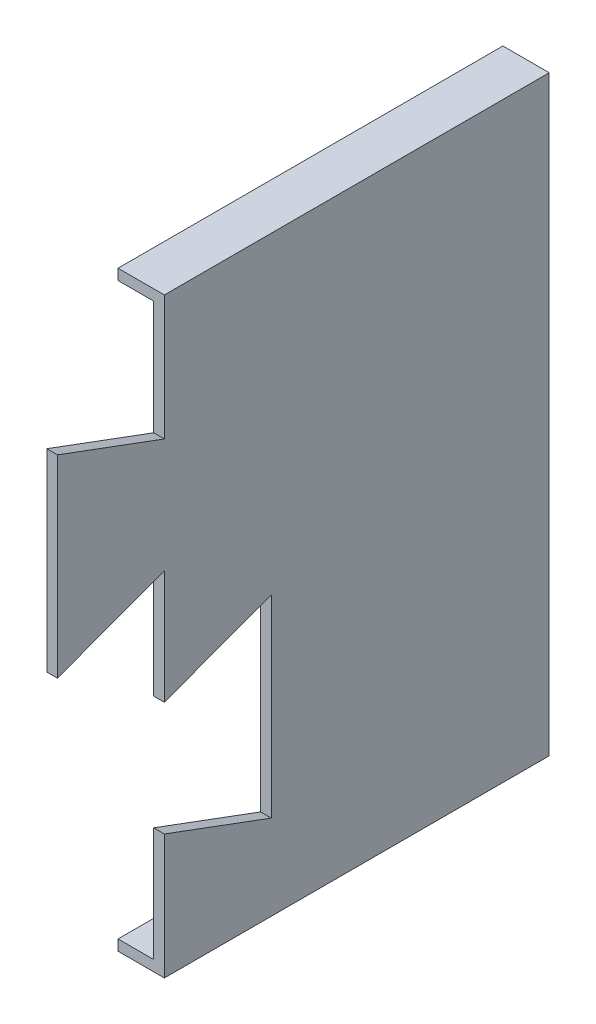
ISO-10303-21;
HEADER;
FILE_DESCRIPTION(('STEP AP214'),'2;1');
FILE_NAME('part.step','',(''),(''),'','','');
FILE_SCHEMA(('AUTOMOTIVE_DESIGN { 1 0 10303 214 1 1 1 1 }'));
ENDSEC;
DATA;
#1=APPLICATION_CONTEXT('core data for automotive mechanical design processes');
#2=APPLICATION_PROTOCOL_DEFINITION('international standard','automotive_design',2000,#1);
#3=PRODUCT_CONTEXT('',#1,'mechanical');
#4=PRODUCT('Part','Part','',(#3));
#5=PRODUCT_RELATED_PRODUCT_CATEGORY('part','',(#4));
#6=PRODUCT_DEFINITION_FORMATION('','',#4);
#7=PRODUCT_DEFINITION_CONTEXT('part definition',#1,'design');
#8=PRODUCT_DEFINITION('design','',#6,#7);
#9=PRODUCT_DEFINITION_SHAPE('','',#8);
#10=(LENGTH_UNIT() NAMED_UNIT(*) SI_UNIT(.MILLI.,.METRE.));
#11=(NAMED_UNIT(*) PLANE_ANGLE_UNIT() SI_UNIT($,.RADIAN.));
#12=(NAMED_UNIT(*) SI_UNIT($,.STERADIAN.) SOLID_ANGLE_UNIT());
#13=UNCERTAINTY_MEASURE_WITH_UNIT(LENGTH_MEASURE(1.E-05),#10,'distance_accuracy_value','');
#14=(GEOMETRIC_REPRESENTATION_CONTEXT(3) GLOBAL_UNCERTAINTY_ASSIGNED_CONTEXT((#13)) GLOBAL_UNIT_ASSIGNED_CONTEXT((#10,
#11,#12)) REPRESENTATION_CONTEXT('',''));
#15=CARTESIAN_POINT('',(0.,0.,0.));
#16=DIRECTION('',(0.,0.,1.));
#17=DIRECTION('',(1.,0.,0.));
#18=AXIS2_PLACEMENT_3D('',#15,#16,#17);
#19=CARTESIAN_POINT('',(-21.6440580045063,19.0350877192983,3.));
#20=DIRECTION('',(1.,0.,0.));
#21=DIRECTION('',(0.,1.,0.));
#22=AXIS2_PLACEMENT_3D('',#19,#20,#21);
#23=PLANE('',#22);
#24=DIRECTION('',(0.,-1.,0.));
#25=VECTOR('',#24,1.);
#26=CARTESIAN_POINT('',(-21.6440580045063,0.,108.));
#27=LINE('',#26,#25);
#28=CARTESIAN_POINT('',(-21.6440580045063,-140.964912280702,108.));
#29=VERTEX_POINT('',#28);
#30=CARTESIAN_POINT('',(-21.6440580045063,-143.964912280702,108.));
#31=VERTEX_POINT('',#30);
#32=EDGE_CURVE('E151',#29,#31,#27,.T.);
#33=ORIENTED_EDGE('',*,*,#32,.F.);
#34=DIRECTION('',(0.,0.,-1.));
#35=VECTOR('',#34,1.);
#36=CARTESIAN_POINT('',(-21.6440580045063,-140.964912280702,0.));
#37=LINE('',#36,#35);
#38=CARTESIAN_POINT('',(-21.6440580045063,-140.964912280702,3.));
#39=VERTEX_POINT('',#38);
#40=EDGE_CURVE('E182',#29,#39,#37,.T.);
#41=ORIENTED_EDGE('',*,*,#40,.T.);
#42=DIRECTION('',(0.,-1.,0.));
#43=VECTOR('',#42,1.);
#44=CARTESIAN_POINT('',(-21.6440580045063,19.0350877192983,3.));
#45=LINE('',#44,#43);
#46=CARTESIAN_POINT('',(-21.6440580045063,19.0350877192983,3.));
#47=VERTEX_POINT('',#46);
#48=EDGE_CURVE('E213',#47,#39,#45,.T.);
#49=ORIENTED_EDGE('',*,*,#48,.F.);
#50=DIRECTION('',(0.,0.,1.));
#51=VECTOR('',#50,1.);
#52=CARTESIAN_POINT('',(-21.6440580045063,19.0350877192983,0.));
#53=LINE('',#52,#51);
#54=CARTESIAN_POINT('',(-21.6440580045063,19.0350877192983,108.));
#55=VERTEX_POINT('',#54);
#56=EDGE_CURVE('E190',#47,#55,#53,.T.);
#57=ORIENTED_EDGE('',*,*,#56,.T.);
#58=DIRECTION('',(0.,-1.,0.));
#59=VECTOR('',#58,1.);
#60=CARTESIAN_POINT('',(-21.6440580045063,0.,108.));
#61=LINE('',#60,#59);
#62=CARTESIAN_POINT('',(-21.6440580045063,22.0350877192983,108.));
#63=VERTEX_POINT('',#62);
#64=EDGE_CURVE('E62',#63,#55,#61,.T.);
#65=ORIENTED_EDGE('',*,*,#64,.F.);
#66=DIRECTION('',(0.,0.,1.));
#67=VECTOR('',#66,1.);
#68=CARTESIAN_POINT('',(-21.6440580045063,22.0350877192983,0.));
#69=LINE('',#68,#67);
#70=CARTESIAN_POINT('',(-21.6440580045063,22.0350877192983,0.));
#71=VERTEX_POINT('',#70);
#72=EDGE_CURVE('E306',#71,#63,#69,.T.);
#73=ORIENTED_EDGE('',*,*,#72,.F.);
#74=DIRECTION('',(0.,-1.,0.));
#75=VECTOR('',#74,1.);
#76=CARTESIAN_POINT('',(-21.6440580045063,19.0350877192983,0.));
#77=LINE('',#76,#75);
#78=CARTESIAN_POINT('',(-21.6440580045063,-143.964912280702,0.));
#79=VERTEX_POINT('',#78);
#80=EDGE_CURVE('E178',#71,#79,#77,.T.);
#81=ORIENTED_EDGE('',*,*,#80,.T.);
#82=DIRECTION('',(0.,0.,-1.));
#83=VECTOR('',#82,1.);
#84=CARTESIAN_POINT('',(-21.6440580045063,-143.964912280702,0.));
#85=LINE('',#84,#83);
#86=EDGE_CURVE('E169',#31,#79,#85,.T.);
#87=ORIENTED_EDGE('',*,*,#86,.F.);
#88=EDGE_LOOP('',(#33,#41,#49,#57,#65,#73,#81,#87));
#89=FACE_BOUND('',#88,.T.);
#90=ADVANCED_FACE('F39',(#89),#23,.F.);
#91=CARTESIAN_POINT('',(-8.64405800450632,19.0350877192983,3.));
#92=DIRECTION('',(-1.,0.,0.));
#93=DIRECTION('',(0.,-1.,0.));
#94=AXIS2_PLACEMENT_3D('',#91,#92,#93);
#95=PLANE('',#94);
#96=DIRECTION('',(0.,-1.,0.));
#97=VECTOR('',#96,1.);
#98=CARTESIAN_POINT('',(-8.64405800450632,0.,108.));
#99=LINE('',#98,#97);
#100=CARTESIAN_POINT('',(-8.64405800450631,-108.964912280702,108.));
#101=VERTEX_POINT('',#100);
#102=CARTESIAN_POINT('',(-8.6440580045063,-143.964912280702,108.));
#103=VERTEX_POINT('',#102);
#104=EDGE_CURVE('E289',#101,#103,#99,.T.);
#105=ORIENTED_EDGE('',*,*,#104,.T.);
#106=DIRECTION('',(0.,0.,1.));
#107=VECTOR('',#106,1.);
#108=CARTESIAN_POINT('',(-8.64405800450632,-143.964912280702,0.));
#109=LINE('',#108,#107);
#110=CARTESIAN_POINT('',(-8.64405800450632,-143.964912280702,0.));
#111=VERTEX_POINT('',#110);
#112=EDGE_CURVE('E172',#111,#103,#109,.T.);
#113=ORIENTED_EDGE('',*,*,#112,.F.);
#114=DIRECTION('',(0.,1.,0.));
#115=VECTOR('',#114,1.);
#116=CARTESIAN_POINT('',(-8.64405800450632,19.0350877192983,0.));
#117=LINE('',#116,#115);
#118=CARTESIAN_POINT('',(-8.64405800450632,22.0350877192983,0.));
#119=VERTEX_POINT('',#118);
#120=EDGE_CURVE('E218',#111,#119,#117,.T.);
#121=ORIENTED_EDGE('',*,*,#120,.T.);
#122=DIRECTION('',(0.,0.,-1.));
#123=VECTOR('',#122,1.);
#124=CARTESIAN_POINT('',(-8.64405800450632,22.0350877192983,0.));
#125=LINE('',#124,#123);
#126=CARTESIAN_POINT('',(-8.64405800450633,22.0350877192983,108.));
#127=VERTEX_POINT('',#126);
#128=EDGE_CURVE('E310',#127,#119,#125,.T.);
#129=ORIENTED_EDGE('',*,*,#128,.F.);
#130=DIRECTION('',(0.,-1.,0.));
#131=VECTOR('',#130,1.);
#132=CARTESIAN_POINT('',(-8.64405800450632,0.,108.));
#133=LINE('',#132,#131);
#134=CARTESIAN_POINT('',(-8.64405800450632,-12.9649122807017,108.));
#135=VERTEX_POINT('',#134);
#136=EDGE_CURVE('E277',#127,#135,#133,.T.);
#137=ORIENTED_EDGE('',*,*,#136,.T.);
#138=DIRECTION('',(0.,-0.347985272676877,-0.9375));
#139=VECTOR('',#138,1.);
#140=CARTESIAN_POINT('',(-8.64405800450632,-46.6284512927443,17.3077486267798));
#141=LINE('',#140,#139);
#142=CARTESIAN_POINT('',(-8.64405800450632,-1.82938355504168,138.));
#143=VERTEX_POINT('',#142);
#144=EDGE_CURVE('E278',#143,#135,#141,.T.);
#145=ORIENTED_EDGE('',*,*,#144,.F.);
#146=DIRECTION('',(0.,1.,0.));
#147=VECTOR('',#146,1.);
#148=CARTESIAN_POINT('',(-8.64405800450632,19.0350877192983,138.));
#149=LINE('',#148,#147);
#150=CARTESIAN_POINT('',(-8.64405800450631,-56.1004410063618,138.));
#151=VERTEX_POINT('',#150);
#152=EDGE_CURVE('E196',#151,#143,#149,.T.);
#153=ORIENTED_EDGE('',*,*,#152,.F.);
#154=DIRECTION('',(0.,-0.347985272676877,0.9375));
#155=VECTOR('',#154,1.);
#156=CARTESIAN_POINT('',(-8.64405800450632,-4.28643357567676,-1.59105680708607));
#157=LINE('',#156,#155);
#158=CARTESIAN_POINT('',(-8.64405800450632,-44.9649122807017,108.));
#159=VERTEX_POINT('',#158);
#160=EDGE_CURVE('E163',#159,#151,#157,.T.);
#161=ORIENTED_EDGE('',*,*,#160,.F.);
#162=DIRECTION('',(0.,1.,0.));
#163=VECTOR('',#162,1.);
#164=CARTESIAN_POINT('',(-8.64405800450632,0.,108.));
#165=LINE('',#164,#163);
#166=CARTESIAN_POINT('',(-8.64405800450631,-76.9649122807017,108.));
#167=VERTEX_POINT('',#166);
#168=EDGE_CURVE('E334',#167,#159,#165,.T.);
#169=ORIENTED_EDGE('',*,*,#168,.F.);
#170=DIRECTION('',(0.,-0.34796875,0.937506132792441));
#171=VECTOR('',#170,1.);
#172=CARTESIAN_POINT('',(-8.64405800450632,-32.4137610438677,-12.030828939367));
#173=LINE('',#172,#171);
#174=CARTESIAN_POINT('',(-8.64405800450631,-65.8299122807017,77.9998037506419));
#175=VERTEX_POINT('',#174);
#176=EDGE_CURVE('E337',#175,#167,#173,.T.);
#177=ORIENTED_EDGE('',*,*,#176,.F.);
#178=DIRECTION('',(0.,1.,0.));
#179=VECTOR('',#178,1.);
#180=CARTESIAN_POINT('',(-8.64405800450632,0.,77.9998037506419));
#181=LINE('',#180,#179);
#182=CARTESIAN_POINT('',(-8.64405800450631,-120.099912280702,77.9998037506419));
#183=VERTEX_POINT('',#182);
#184=EDGE_CURVE('E260',#183,#175,#181,.T.);
#185=ORIENTED_EDGE('',*,*,#184,.F.);
#186=DIRECTION('',(0.,-0.34796875,-0.937506132792441));
#187=VECTOR('',#186,1.);
#188=CARTESIAN_POINT('',(-8.64405800450631,-131.003261835964,48.6237259389483));
#189=LINE('',#188,#187);
#190=EDGE_CURVE('E342',#101,#183,#189,.T.);
#191=ORIENTED_EDGE('',*,*,#190,.F.);
#192=EDGE_LOOP('',(#105,#113,#121,#129,#137,#145,#153,#161,#169,#177,#185,#191));
#193=FACE_BOUND('',#192,.T.);
#194=ADVANCED_FACE('F349',(#193),#95,.F.);
#195=CARTESIAN_POINT('',(-11.6440580045063,19.0350877192983,138.));
#196=DIRECTION('',(1.,0.,0.));
#197=DIRECTION('',(0.,1.,0.));
#198=AXIS2_PLACEMENT_3D('',#195,#196,#197);
#199=PLANE('',#198);
#200=DIRECTION('',(0.,-1.,0.));
#201=VECTOR('',#200,1.);
#202=CARTESIAN_POINT('',(-11.6440580045063,19.0350877192983,108.));
#203=LINE('',#202,#201);
#204=CARTESIAN_POINT('',(-11.6440580045063,-108.964912280702,108.));
#205=VERTEX_POINT('',#204);
#206=CARTESIAN_POINT('',(-11.6440580045063,-140.964912280702,108.));
#207=VERTEX_POINT('',#206);
#208=EDGE_CURVE('E54',#205,#207,#203,.T.);
#209=ORIENTED_EDGE('',*,*,#208,.F.);
#210=DIRECTION('',(0.,-0.34796875,-0.937506132792441));
#211=VECTOR('',#210,1.);
#212=CARTESIAN_POINT('',(-11.6440580045063,-83.6796990413482,176.124055625278));
#213=LINE('',#212,#211);
#214=CARTESIAN_POINT('',(-11.6440580045063,-120.099912280702,77.9998037506419));
#215=VERTEX_POINT('',#214);
#216=EDGE_CURVE('E236',#205,#215,#213,.T.);
#217=ORIENTED_EDGE('',*,*,#216,.T.);
#218=DIRECTION('',(0.,1.,0.));
#219=VECTOR('',#218,1.);
#220=CARTESIAN_POINT('',(-11.6440580045063,19.0350877192983,77.9998037506419));
#221=LINE('',#220,#219);
#222=CARTESIAN_POINT('',(-11.6440580045063,-65.8299122807017,77.9998037506419));
#223=VERTEX_POINT('',#222);
#224=EDGE_CURVE('E240',#215,#223,#221,.T.);
#225=ORIENTED_EDGE('',*,*,#224,.T.);
#226=DIRECTION('',(0.,-0.34796875,0.937506132792441));
#227=VECTOR('',#226,1.);
#228=CARTESIAN_POINT('',(-11.6440580045063,-75.1277013013053,103.050140104772));
#229=LINE('',#228,#227);
#230=CARTESIAN_POINT('',(-11.6440580045063,-76.9649122807017,108.));
#231=VERTEX_POINT('',#230);
#232=EDGE_CURVE('E47',#223,#231,#229,.T.);
#233=ORIENTED_EDGE('',*,*,#232,.T.);
#234=DIRECTION('',(0.,1.,0.));
#235=VECTOR('',#234,1.);
#236=CARTESIAN_POINT('',(-11.6440580045063,19.0350877192983,108.));
#237=LINE('',#236,#235);
#238=CARTESIAN_POINT('',(-11.6440580045063,-44.9649122807017,108.));
#239=VERTEX_POINT('',#238);
#240=EDGE_CURVE('E11',#231,#239,#237,.T.);
#241=ORIENTED_EDGE('',*,*,#240,.T.);
#242=DIRECTION('',(0.,-0.347985272676877,0.9375));
#243=VECTOR('',#242,1.);
#244=CARTESIAN_POINT('',(-11.6440580045063,-47.0019980747389,113.488071139387));
#245=LINE('',#244,#243);
#246=CARTESIAN_POINT('',(-11.6440580045063,-56.1004410063618,138.));
#247=VERTEX_POINT('',#246);
#248=EDGE_CURVE('E303',#239,#247,#245,.T.);
#249=ORIENTED_EDGE('',*,*,#248,.T.);
#250=DIRECTION('',(0.,-1.,0.));
#251=VECTOR('',#250,1.);
#252=CARTESIAN_POINT('',(-11.6440580045063,19.0350877192983,138.));
#253=LINE('',#252,#251);
#254=CARTESIAN_POINT('',(-11.6440580045063,-1.82938355504168,138.));
#255=VERTEX_POINT('',#254);
#256=EDGE_CURVE('E200',#255,#247,#253,.T.);
#257=ORIENTED_EDGE('',*,*,#256,.F.);
#258=DIRECTION('',(0.,-0.347985272676877,-0.9375));
#259=VECTOR('',#258,1.);
#260=CARTESIAN_POINT('',(-11.6440580045063,0.697173513335422,144.806745680306));
#261=LINE('',#260,#259);
#262=CARTESIAN_POINT('',(-11.6440580045063,-12.9649122807017,108.));
#263=VERTEX_POINT('',#262);
#264=EDGE_CURVE('E299',#255,#263,#261,.T.);
#265=ORIENTED_EDGE('',*,*,#264,.T.);
#266=DIRECTION('',(0.,-1.,0.));
#267=VECTOR('',#266,1.);
#268=CARTESIAN_POINT('',(-11.6440580045063,19.0350877192983,108.));
#269=LINE('',#268,#267);
#270=CARTESIAN_POINT('',(-11.6440580045063,19.0350877192983,108.));
#271=VERTEX_POINT('',#270);
#272=EDGE_CURVE('E174',#271,#263,#269,.T.);
#273=ORIENTED_EDGE('',*,*,#272,.F.);
#274=DIRECTION('',(0.,0.,-1.));
#275=VECTOR('',#274,1.);
#276=CARTESIAN_POINT('',(-11.6440580045063,19.0350877192983,138.));
#277=LINE('',#276,#275);
#278=CARTESIAN_POINT('',(-11.6440580045063,19.0350877192983,3.));
#279=VERTEX_POINT('',#278);
#280=EDGE_CURVE('E210',#271,#279,#277,.T.);
#281=ORIENTED_EDGE('',*,*,#280,.T.);
#282=DIRECTION('',(0.,-1.,0.));
#283=VECTOR('',#282,1.);
#284=CARTESIAN_POINT('',(-11.6440580045063,19.0350877192983,3.));
#285=LINE('',#284,#283);
#286=CARTESIAN_POINT('',(-11.6440580045063,-140.964912280702,3.));
#287=VERTEX_POINT('',#286);
#288=EDGE_CURVE('E194',#279,#287,#285,.T.);
#289=ORIENTED_EDGE('',*,*,#288,.T.);
#290=DIRECTION('',(0.,0.,-1.));
#291=VECTOR('',#290,1.);
#292=CARTESIAN_POINT('',(-11.6440580045063,-140.964912280702,138.));
#293=LINE('',#292,#291);
#294=EDGE_CURVE('E204',#207,#287,#293,.T.);
#295=ORIENTED_EDGE('',*,*,#294,.F.);
#296=EDGE_LOOP('',(#209,#217,#225,#233,#241,#249,#257,#265,#273,#281,#289,#295));
#297=FACE_BOUND('',#296,.T.);
#298=ADVANCED_FACE('F246',(#297),#199,.F.);
#299=CARTESIAN_POINT('',(0.,-143.964912280702,0.));
#300=DIRECTION('',(0.,1.,0.));
#301=DIRECTION('',(0.,0.,1.));
#302=AXIS2_PLACEMENT_3D('',#299,#300,#301);
#303=PLANE('',#302);
#304=DIRECTION('',(1.,0.,0.));
#305=VECTOR('',#304,1.);
#306=CARTESIAN_POINT('',(-21.6440580045063,-143.964912280702,108.));
#307=LINE('',#306,#305);
#308=EDGE_CURVE('E155',#31,#103,#307,.T.);
#309=ORIENTED_EDGE('',*,*,#308,.F.);
#310=ORIENTED_EDGE('',*,*,#86,.T.);
#311=DIRECTION('',(1.,0.,0.));
#312=VECTOR('',#311,1.);
#313=CARTESIAN_POINT('',(-21.6440580045063,-143.964912280702,0.));
#314=LINE('',#313,#312);
#315=EDGE_CURVE('E181',#79,#111,#314,.T.);
#316=ORIENTED_EDGE('',*,*,#315,.T.);
#317=ORIENTED_EDGE('',*,*,#112,.T.);
#318=EDGE_LOOP('',(#309,#310,#316,#317));
#319=FACE_BOUND('',#318,.T.);
#320=ADVANCED_FACE('F167',(#319),#303,.F.);
#321=CARTESIAN_POINT('',(0.,-140.964912280702,0.));
#322=DIRECTION('',(0.,1.,0.));
#323=DIRECTION('',(0.,0.,1.));
#324=AXIS2_PLACEMENT_3D('',#321,#322,#323);
#325=PLANE('',#324);
#326=ORIENTED_EDGE('',*,*,#40,.F.);
#327=DIRECTION('',(1.,0.,0.));
#328=VECTOR('',#327,1.);
#329=CARTESIAN_POINT('',(0.,-140.964912280702,108.));
#330=LINE('',#329,#328);
#331=EDGE_CURVE('E157',#29,#207,#330,.T.);
#332=ORIENTED_EDGE('',*,*,#331,.T.);
#333=ORIENTED_EDGE('',*,*,#294,.T.);
#334=DIRECTION('',(1.,0.,0.));
#335=VECTOR('',#334,1.);
#336=CARTESIAN_POINT('',(-21.6440580045063,-140.964912280702,3.));
#337=LINE('',#336,#335);
#338=EDGE_CURVE('E217',#39,#287,#337,.T.);
#339=ORIENTED_EDGE('',*,*,#338,.F.);
#340=EDGE_LOOP('',(#326,#332,#333,#339));
#341=FACE_BOUND('',#340,.T.);
#342=ADVANCED_FACE('F355',(#341),#325,.T.);
#343=CARTESIAN_POINT('',(0.,22.0350877192983,0.));
#344=DIRECTION('',(0.,1.,0.));
#345=DIRECTION('',(0.,0.,1.));
#346=AXIS2_PLACEMENT_3D('',#343,#344,#345);
#347=PLANE('',#346);
#348=ORIENTED_EDGE('',*,*,#72,.T.);
#349=DIRECTION('',(1.,0.,0.));
#350=VECTOR('',#349,1.);
#351=CARTESIAN_POINT('',(-21.6440580045063,22.0350877192983,108.));
#352=LINE('',#351,#350);
#353=EDGE_CURVE('E285',#63,#127,#352,.T.);
#354=ORIENTED_EDGE('',*,*,#353,.T.);
#355=ORIENTED_EDGE('',*,*,#128,.T.);
#356=DIRECTION('',(-1.,0.,0.));
#357=VECTOR('',#356,1.);
#358=CARTESIAN_POINT('',(-21.6440580045063,22.0350877192983,0.));
#359=LINE('',#358,#357);
#360=EDGE_CURVE('E187',#119,#71,#359,.T.);
#361=ORIENTED_EDGE('',*,*,#360,.T.);
#362=EDGE_LOOP('',(#348,#354,#355,#361));
#363=FACE_BOUND('',#362,.T.);
#364=ADVANCED_FACE('F316',(#363),#347,.T.);
#365=CARTESIAN_POINT('',(0.,19.0350877192983,0.));
#366=DIRECTION('',(0.,1.,0.));
#367=DIRECTION('',(0.,0.,1.));
#368=AXIS2_PLACEMENT_3D('',#365,#366,#367);
#369=PLANE('',#368);
#370=DIRECTION('',(1.,0.,0.));
#371=VECTOR('',#370,1.);
#372=CARTESIAN_POINT('',(0.,19.0350877192983,108.));
#373=LINE('',#372,#371);
#374=EDGE_CURVE('E226',#55,#271,#373,.T.);
#375=ORIENTED_EDGE('',*,*,#374,.F.);
#376=ORIENTED_EDGE('',*,*,#56,.F.);
#377=DIRECTION('',(-1.,0.,0.));
#378=VECTOR('',#377,1.);
#379=CARTESIAN_POINT('',(-21.6440580045063,19.0350877192983,3.));
#380=LINE('',#379,#378);
#381=EDGE_CURVE('E222',#279,#47,#380,.T.);
#382=ORIENTED_EDGE('',*,*,#381,.F.);
#383=ORIENTED_EDGE('',*,*,#280,.F.);
#384=EDGE_LOOP('',(#375,#376,#382,#383));
#385=FACE_BOUND('',#384,.T.);
#386=ADVANCED_FACE('F359',(#385),#369,.F.);
#387=CARTESIAN_POINT('',(0.,0.,3.));
#388=DIRECTION('',(0.,0.,1.));
#389=DIRECTION('',(1.,0.,0.));
#390=AXIS2_PLACEMENT_3D('',#387,#388,#389);
#391=PLANE('',#390);
#392=ORIENTED_EDGE('',*,*,#288,.F.);
#393=ORIENTED_EDGE('',*,*,#381,.T.);
#394=ORIENTED_EDGE('',*,*,#48,.T.);
#395=ORIENTED_EDGE('',*,*,#338,.T.);
#396=EDGE_LOOP('',(#392,#393,#394,#395));
#397=FACE_BOUND('',#396,.T.);
#398=ADVANCED_FACE('F357',(#397),#391,.T.);
#399=CARTESIAN_POINT('',(0.,0.,0.));
#400=DIRECTION('',(0.,0.,1.));
#401=DIRECTION('',(1.,0.,0.));
#402=AXIS2_PLACEMENT_3D('',#399,#400,#401);
#403=PLANE('',#402);
#404=ORIENTED_EDGE('',*,*,#80,.F.);
#405=ORIENTED_EDGE('',*,*,#360,.F.);
#406=ORIENTED_EDGE('',*,*,#120,.F.);
#407=ORIENTED_EDGE('',*,*,#315,.F.);
#408=EDGE_LOOP('',(#404,#405,#406,#407));
#409=FACE_BOUND('',#408,.T.);
#410=ADVANCED_FACE('F369',(#409),#403,.F.);
#411=CARTESIAN_POINT('',(0.,0.,138.));
#412=DIRECTION('',(0.,0.,-1.));
#413=DIRECTION('',(-1.,0.,0.));
#414=AXIS2_PLACEMENT_3D('',#411,#412,#413);
#415=PLANE('',#414);
#416=ORIENTED_EDGE('',*,*,#256,.T.);
#417=DIRECTION('',(1.,0.,0.));
#418=VECTOR('',#417,1.);
#419=CARTESIAN_POINT('',(-21.6440580045063,-56.1004410063618,138.));
#420=LINE('',#419,#418);
#421=EDGE_CURVE('E175',#247,#151,#420,.T.);
#422=ORIENTED_EDGE('',*,*,#421,.T.);
#423=ORIENTED_EDGE('',*,*,#152,.T.);
#424=DIRECTION('',(1.,0.,0.));
#425=VECTOR('',#424,1.);
#426=CARTESIAN_POINT('',(-21.6440580045063,-1.82938355504169,138.));
#427=LINE('',#426,#425);
#428=EDGE_CURVE('E276',#255,#143,#427,.T.);
#429=ORIENTED_EDGE('',*,*,#428,.F.);
#430=EDGE_LOOP('',(#416,#422,#423,#429));
#431=FACE_BOUND('',#430,.T.);
#432=ADVANCED_FACE('F371',(#431),#415,.F.);
#433=CARTESIAN_POINT('',(-21.6440580045063,-46.6284512927443,17.3077486267798));
#434=DIRECTION('',(0.,-0.9375,0.347985272676876));
#435=DIRECTION('',(0.,-0.347985272676877,-0.9375));
#436=AXIS2_PLACEMENT_3D('',#433,#434,#435);
#437=PLANE('',#436);
#438=ORIENTED_EDGE('',*,*,#428,.T.);
#439=ORIENTED_EDGE('',*,*,#144,.T.);
#440=DIRECTION('',(1.,0.,0.));
#441=VECTOR('',#440,1.);
#442=CARTESIAN_POINT('',(-21.6440580045063,-12.9649122807017,108.));
#443=LINE('',#442,#441);
#444=EDGE_CURVE('E290',#263,#135,#443,.T.);
#445=ORIENTED_EDGE('',*,*,#444,.F.);
#446=ORIENTED_EDGE('',*,*,#264,.F.);
#447=EDGE_LOOP('',(#438,#439,#445,#446));
#448=FACE_BOUND('',#447,.T.);
#449=ADVANCED_FACE('F365',(#448),#437,.F.);
#450=CARTESIAN_POINT('',(-21.6440580045063,0.,108.));
#451=DIRECTION('',(0.,0.,1.));
#452=DIRECTION('',(1.,0.,0.));
#453=AXIS2_PLACEMENT_3D('',#450,#451,#452);
#454=PLANE('',#453);
#455=ORIENTED_EDGE('',*,*,#272,.T.);
#456=ORIENTED_EDGE('',*,*,#444,.T.);
#457=ORIENTED_EDGE('',*,*,#136,.F.);
#458=ORIENTED_EDGE('',*,*,#353,.F.);
#459=ORIENTED_EDGE('',*,*,#64,.T.);
#460=ORIENTED_EDGE('',*,*,#374,.T.);
#461=EDGE_LOOP('',(#455,#456,#457,#458,#459,#460));
#462=FACE_BOUND('',#461,.T.);
#463=ADVANCED_FACE('F363',(#462),#454,.T.);
#464=CARTESIAN_POINT('',(-21.6440580045063,0.,108.));
#465=DIRECTION('',(0.,0.,-1.));
#466=DIRECTION('',(-1.,0.,0.));
#467=AXIS2_PLACEMENT_3D('',#464,#465,#466);
#468=PLANE('',#467);
#469=DIRECTION('',(1.,0.,0.));
#470=VECTOR('',#469,1.);
#471=CARTESIAN_POINT('',(-21.6440580045063,-76.9649122807017,108.));
#472=LINE('',#471,#470);
#473=EDGE_CURVE('E255',#231,#167,#472,.T.);
#474=ORIENTED_EDGE('',*,*,#473,.T.);
#475=ORIENTED_EDGE('',*,*,#168,.T.);
#476=DIRECTION('',(1.,0.,0.));
#477=VECTOR('',#476,1.);
#478=CARTESIAN_POINT('',(-21.6440580045063,-44.9649122807017,108.));
#479=LINE('',#478,#477);
#480=EDGE_CURVE('E267',#239,#159,#479,.T.);
#481=ORIENTED_EDGE('',*,*,#480,.F.);
#482=ORIENTED_EDGE('',*,*,#240,.F.);
#483=EDGE_LOOP('',(#474,#475,#481,#482));
#484=FACE_BOUND('',#483,.T.);
#485=ADVANCED_FACE('F403',(#484),#468,.F.);
#486=CARTESIAN_POINT('',(-21.6440580045063,-32.4137610438677,-12.030828939367));
#487=DIRECTION('',(0.,0.937506132792441,0.34796875));
#488=DIRECTION('',(0.,-0.34796875,0.937506132792441));
#489=AXIS2_PLACEMENT_3D('',#486,#487,#488);
#490=PLANE('',#489);
#491=DIRECTION('',(1.,0.,0.));
#492=VECTOR('',#491,1.);
#493=CARTESIAN_POINT('',(-21.6440580045063,-65.8299122807017,77.9998037506419));
#494=LINE('',#493,#492);
#495=EDGE_CURVE('E253',#223,#175,#494,.T.);
#496=ORIENTED_EDGE('',*,*,#495,.T.);
#497=ORIENTED_EDGE('',*,*,#176,.T.);
#498=ORIENTED_EDGE('',*,*,#473,.F.);
#499=ORIENTED_EDGE('',*,*,#232,.F.);
#500=EDGE_LOOP('',(#496,#497,#498,#499));
#501=FACE_BOUND('',#500,.T.);
#502=ADVANCED_FACE('F251',(#501),#490,.F.);
#503=CARTESIAN_POINT('',(-21.6440580045063,0.,77.9998037506419));
#504=DIRECTION('',(0.,0.,-1.));
#505=DIRECTION('',(-1.,0.,0.));
#506=AXIS2_PLACEMENT_3D('',#503,#504,#505);
#507=PLANE('',#506);
#508=DIRECTION('',(1.,0.,0.));
#509=VECTOR('',#508,1.);
#510=CARTESIAN_POINT('',(-21.6440580045063,-120.099912280702,77.9998037506419));
#511=LINE('',#510,#509);
#512=EDGE_CURVE('E263',#215,#183,#511,.T.);
#513=ORIENTED_EDGE('',*,*,#512,.T.);
#514=ORIENTED_EDGE('',*,*,#184,.T.);
#515=ORIENTED_EDGE('',*,*,#495,.F.);
#516=ORIENTED_EDGE('',*,*,#224,.F.);
#517=EDGE_LOOP('',(#513,#514,#515,#516));
#518=FACE_BOUND('',#517,.T.);
#519=ADVANCED_FACE('F257',(#518),#507,.F.);
#520=CARTESIAN_POINT('',(-21.6440580045063,-131.003261835964,48.6237259389483));
#521=DIRECTION('',(0.,-0.937506132792441,0.34796875));
#522=DIRECTION('',(0.,-0.34796875,-0.937506132792441));
#523=AXIS2_PLACEMENT_3D('',#520,#521,#522);
#524=PLANE('',#523);
#525=DIRECTION('',(1.,0.,0.));
#526=VECTOR('',#525,1.);
#527=CARTESIAN_POINT('',(-21.6440580045063,-108.964912280702,108.));
#528=LINE('',#527,#526);
#529=EDGE_CURVE('E162',#205,#101,#528,.T.);
#530=ORIENTED_EDGE('',*,*,#529,.T.);
#531=ORIENTED_EDGE('',*,*,#190,.T.);
#532=ORIENTED_EDGE('',*,*,#512,.F.);
#533=ORIENTED_EDGE('',*,*,#216,.F.);
#534=EDGE_LOOP('',(#530,#531,#532,#533));
#535=FACE_BOUND('',#534,.T.);
#536=ADVANCED_FACE('F407',(#535),#524,.F.);
#537=CARTESIAN_POINT('',(-21.6440580045063,-4.28643357567676,-1.59105680708607));
#538=DIRECTION('',(0.,0.9375,0.347985272676876));
#539=DIRECTION('',(0.,-0.347985272676877,0.9375));
#540=AXIS2_PLACEMENT_3D('',#537,#538,#539);
#541=PLANE('',#540);
#542=ORIENTED_EDGE('',*,*,#480,.T.);
#543=ORIENTED_EDGE('',*,*,#160,.T.);
#544=ORIENTED_EDGE('',*,*,#421,.F.);
#545=ORIENTED_EDGE('',*,*,#248,.F.);
#546=EDGE_LOOP('',(#542,#543,#544,#545));
#547=FACE_BOUND('',#546,.T.);
#548=ADVANCED_FACE('F406',(#547),#541,.F.);
#549=CARTESIAN_POINT('',(-21.6440580045063,0.,108.));
#550=DIRECTION('',(0.,0.,1.));
#551=DIRECTION('',(1.,0.,0.));
#552=AXIS2_PLACEMENT_3D('',#549,#550,#551);
#553=PLANE('',#552);
#554=ORIENTED_EDGE('',*,*,#208,.T.);
#555=ORIENTED_EDGE('',*,*,#331,.F.);
#556=ORIENTED_EDGE('',*,*,#32,.T.);
#557=ORIENTED_EDGE('',*,*,#308,.T.);
#558=ORIENTED_EDGE('',*,*,#104,.F.);
#559=ORIENTED_EDGE('',*,*,#529,.F.);
#560=EDGE_LOOP('',(#554,#555,#556,#557,#558,#559));
#561=FACE_BOUND('',#560,.T.);
#562=ADVANCED_FACE('F153',(#561),#553,.T.);
#563=CLOSED_SHELL('',(#90,#194,#298,#320,#342,#364,#386,#398,#410,#432,#449,#463,#485,#502,#519,
#536,#548,#562));
#564=MANIFOLD_SOLID_BREP('B2',#563);
#565=ADVANCED_BREP_SHAPE_REPRESENTATION('',(#18,#564),#14);
#566=SHAPE_DEFINITION_REPRESENTATION(#9,#565);
ENDSEC;
END-ISO-10303-21;
